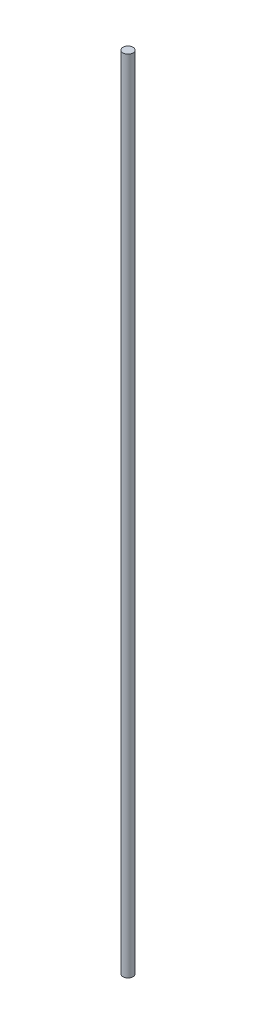
ISO-10303-21;
HEADER;
FILE_DESCRIPTION(('STEP AP214'),'2;1');
FILE_NAME('part.step','',(''),(''),'','','');
FILE_SCHEMA(('AUTOMOTIVE_DESIGN { 1 0 10303 214 1 1 1 1 }'));
ENDSEC;
DATA;
#1=APPLICATION_CONTEXT('core data for automotive mechanical design processes');
#2=APPLICATION_PROTOCOL_DEFINITION('international standard','automotive_design',2000,#1);
#3=PRODUCT_CONTEXT('',#1,'mechanical');
#4=PRODUCT('Part','Part','',(#3));
#5=PRODUCT_RELATED_PRODUCT_CATEGORY('part','',(#4));
#6=PRODUCT_DEFINITION_FORMATION('','',#4);
#7=PRODUCT_DEFINITION_CONTEXT('part definition',#1,'design');
#8=PRODUCT_DEFINITION('design','',#6,#7);
#9=PRODUCT_DEFINITION_SHAPE('','',#8);
#10=(LENGTH_UNIT() NAMED_UNIT(*) SI_UNIT(.MILLI.,.METRE.));
#11=(NAMED_UNIT(*) PLANE_ANGLE_UNIT() SI_UNIT($,.RADIAN.));
#12=(NAMED_UNIT(*) SI_UNIT($,.STERADIAN.) SOLID_ANGLE_UNIT());
#13=UNCERTAINTY_MEASURE_WITH_UNIT(LENGTH_MEASURE(1.E-05),#10,'distance_accuracy_value','');
#14=(GEOMETRIC_REPRESENTATION_CONTEXT(3) GLOBAL_UNCERTAINTY_ASSIGNED_CONTEXT((#13)) GLOBAL_UNIT_ASSIGNED_CONTEXT((#10,
#11,#12)) REPRESENTATION_CONTEXT('',''));
#15=CARTESIAN_POINT('',(0.,0.,0.));
#16=DIRECTION('',(0.,0.,1.));
#17=DIRECTION('',(1.,0.,0.));
#18=AXIS2_PLACEMENT_3D('',#15,#16,#17);
#19=CARTESIAN_POINT('',(0.,254.,0.));
#20=DIRECTION('',(0.,-1.,0.));
#21=DIRECTION('',(0.,0.,-1.));
#22=AXIS2_PLACEMENT_3D('',#19,#20,#21);
#23=CYLINDRICAL_SURFACE('',#22,1.5875);
#24=CARTESIAN_POINT('',(0.,254.,0.));
#25=DIRECTION('',(0.,1.,0.));
#26=DIRECTION('',(0.,0.,1.));
#27=AXIS2_PLACEMENT_3D('',#24,#25,#26);
#28=CIRCLE('',#27,1.5875);
#29=CARTESIAN_POINT('',(0.,254.,1.5875));
#30=VERTEX_POINT('',#29);
#31=EDGE_CURVE('E10',#30,#30,#28,.T.);
#32=ORIENTED_EDGE('',*,*,#31,.F.);
#33=EDGE_LOOP('',(#32));
#34=FACE_BOUND('',#33,.T.);
#35=CARTESIAN_POINT('',(0.,0.,0.));
#36=DIRECTION('',(0.,1.,0.));
#37=DIRECTION('',(0.,0.,1.));
#38=AXIS2_PLACEMENT_3D('',#35,#36,#37);
#39=CIRCLE('',#38,1.5875);
#40=CARTESIAN_POINT('',(0.,0.,1.5875));
#41=VERTEX_POINT('',#40);
#42=EDGE_CURVE('E34',#41,#41,#39,.T.);
#43=ORIENTED_EDGE('',*,*,#42,.T.);
#44=EDGE_LOOP('',(#43));
#45=FACE_BOUND('',#44,.T.);
#46=ADVANCED_FACE('F31',(#34,#45),#23,.T.);
#47=CARTESIAN_POINT('',(0.,254.,0.));
#48=DIRECTION('',(0.,1.,0.));
#49=DIRECTION('',(0.,0.,1.));
#50=AXIS2_PLACEMENT_3D('',#47,#48,#49);
#51=PLANE('',#50);
#52=ORIENTED_EDGE('',*,*,#31,.T.);
#53=EDGE_LOOP('',(#52));
#54=FACE_BOUND('',#53,.T.);
#55=ADVANCED_FACE('F46',(#54),#51,.T.);
#56=CARTESIAN_POINT('',(0.,0.,0.));
#57=DIRECTION('',(0.,1.,0.));
#58=DIRECTION('',(0.,0.,1.));
#59=AXIS2_PLACEMENT_3D('',#56,#57,#58);
#60=PLANE('',#59);
#61=ORIENTED_EDGE('',*,*,#42,.F.);
#62=EDGE_LOOP('',(#61));
#63=FACE_BOUND('',#62,.T.);
#64=ADVANCED_FACE('F44',(#63),#60,.F.);
#65=CLOSED_SHELL('',(#46,#55,#64));
#66=MANIFOLD_SOLID_BREP('B2',#65);
#67=ADVANCED_BREP_SHAPE_REPRESENTATION('',(#18,#66),#14);
#68=SHAPE_DEFINITION_REPRESENTATION(#9,#67);
ENDSEC;
END-ISO-10303-21;
